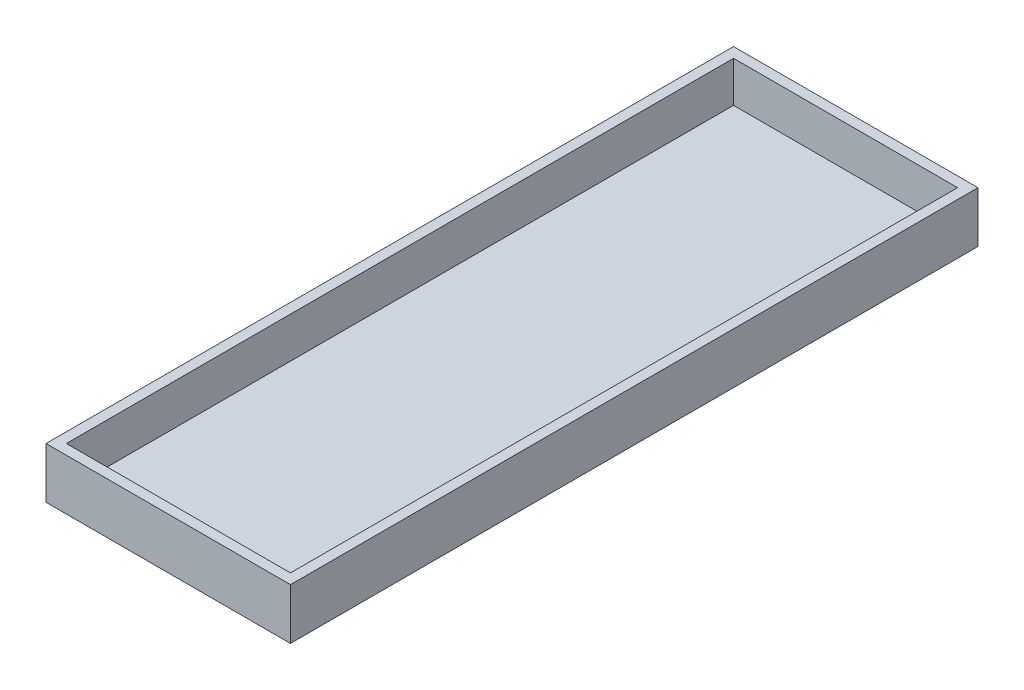
ISO-10303-21;
HEADER;
FILE_DESCRIPTION(('STEP AP214'),'2;1');
FILE_NAME('part.step','',(''),(''),'','','');
FILE_SCHEMA(('AUTOMOTIVE_DESIGN { 1 0 10303 214 1 1 1 1 }'));
ENDSEC;
DATA;
#1=APPLICATION_CONTEXT('core data for automotive mechanical design processes');
#2=APPLICATION_PROTOCOL_DEFINITION('international standard','automotive_design',2000,#1);
#3=PRODUCT_CONTEXT('',#1,'mechanical');
#4=PRODUCT('Part','Part','',(#3));
#5=PRODUCT_RELATED_PRODUCT_CATEGORY('part','',(#4));
#6=PRODUCT_DEFINITION_FORMATION('','',#4);
#7=PRODUCT_DEFINITION_CONTEXT('part definition',#1,'design');
#8=PRODUCT_DEFINITION('design','',#6,#7);
#9=PRODUCT_DEFINITION_SHAPE('','',#8);
#10=(LENGTH_UNIT() NAMED_UNIT(*) SI_UNIT(.MILLI.,.METRE.));
#11=(NAMED_UNIT(*) PLANE_ANGLE_UNIT() SI_UNIT($,.RADIAN.));
#12=(NAMED_UNIT(*) SI_UNIT($,.STERADIAN.) SOLID_ANGLE_UNIT());
#13=UNCERTAINTY_MEASURE_WITH_UNIT(LENGTH_MEASURE(1.E-05),#10,'distance_accuracy_value','');
#14=(GEOMETRIC_REPRESENTATION_CONTEXT(3) GLOBAL_UNCERTAINTY_ASSIGNED_CONTEXT((#13)) GLOBAL_UNIT_ASSIGNED_CONTEXT((#10,
#11,#12)) REPRESENTATION_CONTEXT('',''));
#15=CARTESIAN_POINT('',(0.,0.,0.));
#16=DIRECTION('',(0.,0.,1.));
#17=DIRECTION('',(1.,0.,0.));
#18=AXIS2_PLACEMENT_3D('',#15,#16,#17);
#19=CARTESIAN_POINT('',(0.,20.,-270.));
#20=DIRECTION('',(0.,1.,0.));
#21=DIRECTION('',(-1.,0.,0.));
#22=AXIS2_PLACEMENT_3D('',#19,#20,#21);
#23=PLANE('',#22);
#24=DIRECTION('',(-1.,0.,0.));
#25=VECTOR('',#24,1.);
#26=CARTESIAN_POINT('',(0.,20.,0.));
#27=LINE('',#26,#25);
#28=CARTESIAN_POINT('',(96.,20.,0.));
#29=VERTEX_POINT('',#28);
#30=CARTESIAN_POINT('',(0.,20.,0.));
#31=VERTEX_POINT('',#30);
#32=EDGE_CURVE('E150',#29,#31,#27,.T.);
#33=ORIENTED_EDGE('',*,*,#32,.F.);
#34=DIRECTION('',(0.,0.,1.));
#35=VECTOR('',#34,1.);
#36=CARTESIAN_POINT('',(96.,20.,-270.));
#37=LINE('',#36,#35);
#38=CARTESIAN_POINT('',(96.,20.,-270.));
#39=VERTEX_POINT('',#38);
#40=EDGE_CURVE('E42',#39,#29,#37,.T.);
#41=ORIENTED_EDGE('',*,*,#40,.F.);
#42=DIRECTION('',(-1.,0.,0.));
#43=VECTOR('',#42,1.);
#44=CARTESIAN_POINT('',(0.,20.,-270.));
#45=LINE('',#44,#43);
#46=CARTESIAN_POINT('',(0.,20.,-270.));
#47=VERTEX_POINT('',#46);
#48=EDGE_CURVE('E155',#39,#47,#45,.T.);
#49=ORIENTED_EDGE('',*,*,#48,.T.);
#50=DIRECTION('',(0.,0.,1.));
#51=VECTOR('',#50,1.);
#52=CARTESIAN_POINT('',(0.,20.,-270.));
#53=LINE('',#52,#51);
#54=EDGE_CURVE('E11',#47,#31,#53,.T.);
#55=ORIENTED_EDGE('',*,*,#54,.T.);
#56=EDGE_LOOP('',(#33,#41,#49,#55));
#57=FACE_BOUND('',#56,.T.);
#58=DIRECTION('',(0.,0.,1.));
#59=VECTOR('',#58,1.);
#60=CARTESIAN_POINT('',(92.,20.,-270.));
#61=LINE('',#60,#59);
#62=CARTESIAN_POINT('',(92.,20.,-266.));
#63=VERTEX_POINT('',#62);
#64=CARTESIAN_POINT('',(92.,20.,-4.));
#65=VERTEX_POINT('',#64);
#66=EDGE_CURVE('E138',#63,#65,#61,.T.);
#67=ORIENTED_EDGE('',*,*,#66,.T.);
#68=DIRECTION('',(-1.,0.,0.));
#69=VECTOR('',#68,1.);
#70=CARTESIAN_POINT('',(0.,20.,-4.));
#71=LINE('',#70,#69);
#72=CARTESIAN_POINT('',(4.,20.,-4.));
#73=VERTEX_POINT('',#72);
#74=EDGE_CURVE('E133',#65,#73,#71,.T.);
#75=ORIENTED_EDGE('',*,*,#74,.T.);
#76=DIRECTION('',(0.,0.,1.));
#77=VECTOR('',#76,1.);
#78=CARTESIAN_POINT('',(4.,20.,-270.));
#79=LINE('',#78,#77);
#80=CARTESIAN_POINT('',(4.,20.,-266.));
#81=VERTEX_POINT('',#80);
#82=EDGE_CURVE('E129',#81,#73,#79,.T.);
#83=ORIENTED_EDGE('',*,*,#82,.F.);
#84=DIRECTION('',(-1.,0.,0.));
#85=VECTOR('',#84,1.);
#86=CARTESIAN_POINT('',(0.,20.,-266.));
#87=LINE('',#86,#85);
#88=EDGE_CURVE('E50',#63,#81,#87,.T.);
#89=ORIENTED_EDGE('',*,*,#88,.F.);
#90=EDGE_LOOP('',(#67,#75,#83,#89));
#91=FACE_BOUND('',#90,.T.);
#92=ADVANCED_FACE('F33',(#57,#91),#23,.T.);
#93=CARTESIAN_POINT('',(0.,0.,-270.));
#94=DIRECTION('',(-1.,0.,0.));
#95=DIRECTION('',(0.,0.,1.));
#96=AXIS2_PLACEMENT_3D('',#93,#94,#95);
#97=PLANE('',#96);
#98=DIRECTION('',(0.,-1.,0.));
#99=VECTOR('',#98,1.);
#100=CARTESIAN_POINT('',(0.,0.,0.));
#101=LINE('',#100,#99);
#102=CARTESIAN_POINT('',(0.,0.,0.));
#103=VERTEX_POINT('',#102);
#104=EDGE_CURVE('E142',#31,#103,#101,.T.);
#105=ORIENTED_EDGE('',*,*,#104,.F.);
#106=ORIENTED_EDGE('',*,*,#54,.F.);
#107=DIRECTION('',(0.,-1.,0.));
#108=VECTOR('',#107,1.);
#109=CARTESIAN_POINT('',(0.,0.,-270.));
#110=LINE('',#109,#108);
#111=CARTESIAN_POINT('',(0.,0.,-270.));
#112=VERTEX_POINT('',#111);
#113=EDGE_CURVE('E147',#47,#112,#110,.T.);
#114=ORIENTED_EDGE('',*,*,#113,.T.);
#115=DIRECTION('',(0.,0.,1.));
#116=VECTOR('',#115,1.);
#117=CARTESIAN_POINT('',(0.,0.,-270.));
#118=LINE('',#117,#116);
#119=EDGE_CURVE('E37',#112,#103,#118,.T.);
#120=ORIENTED_EDGE('',*,*,#119,.T.);
#121=EDGE_LOOP('',(#105,#106,#114,#120));
#122=FACE_BOUND('',#121,.T.);
#123=ADVANCED_FACE('F35',(#122),#97,.T.);
#124=CARTESIAN_POINT('',(96.,0.,-270.));
#125=DIRECTION('',(1.,0.,0.));
#126=DIRECTION('',(0.,0.,-1.));
#127=AXIS2_PLACEMENT_3D('',#124,#125,#126);
#128=PLANE('',#127);
#129=DIRECTION('',(0.,1.,0.));
#130=VECTOR('',#129,1.);
#131=CARTESIAN_POINT('',(96.,0.,0.));
#132=LINE('',#131,#130);
#133=CARTESIAN_POINT('',(96.,0.,0.));
#134=VERTEX_POINT('',#133);
#135=EDGE_CURVE('E162',#134,#29,#132,.T.);
#136=ORIENTED_EDGE('',*,*,#135,.F.);
#137=DIRECTION('',(0.,0.,1.));
#138=VECTOR('',#137,1.);
#139=CARTESIAN_POINT('',(96.,0.,-270.));
#140=LINE('',#139,#138);
#141=CARTESIAN_POINT('',(96.,0.,-270.));
#142=VERTEX_POINT('',#141);
#143=EDGE_CURVE('E167',#142,#134,#140,.T.);
#144=ORIENTED_EDGE('',*,*,#143,.F.);
#145=DIRECTION('',(0.,1.,0.));
#146=VECTOR('',#145,1.);
#147=CARTESIAN_POINT('',(96.,0.,-270.));
#148=LINE('',#147,#146);
#149=EDGE_CURVE('E152',#142,#39,#148,.T.);
#150=ORIENTED_EDGE('',*,*,#149,.T.);
#151=ORIENTED_EDGE('',*,*,#40,.T.);
#152=EDGE_LOOP('',(#136,#144,#150,#151));
#153=FACE_BOUND('',#152,.T.);
#154=ADVANCED_FACE('F176',(#153),#128,.T.);
#155=CARTESIAN_POINT('',(0.,0.,-270.));
#156=DIRECTION('',(0.,-1.,0.));
#157=DIRECTION('',(0.,0.,-1.));
#158=AXIS2_PLACEMENT_3D('',#155,#156,#157);
#159=PLANE('',#158);
#160=DIRECTION('',(1.,0.,0.));
#161=VECTOR('',#160,1.);
#162=CARTESIAN_POINT('',(0.,0.,0.));
#163=LINE('',#162,#161);
#164=EDGE_CURVE('E159',#103,#134,#163,.T.);
#165=ORIENTED_EDGE('',*,*,#164,.F.);
#166=ORIENTED_EDGE('',*,*,#119,.F.);
#167=DIRECTION('',(1.,0.,0.));
#168=VECTOR('',#167,1.);
#169=CARTESIAN_POINT('',(0.,0.,-270.));
#170=LINE('',#169,#168);
#171=EDGE_CURVE('E149',#112,#142,#170,.T.);
#172=ORIENTED_EDGE('',*,*,#171,.T.);
#173=ORIENTED_EDGE('',*,*,#143,.T.);
#174=EDGE_LOOP('',(#165,#166,#172,#173));
#175=FACE_BOUND('',#174,.T.);
#176=ADVANCED_FACE('F169',(#175),#159,.T.);
#177=CARTESIAN_POINT('',(0.,0.,-270.));
#178=DIRECTION('',(0.,0.,-1.));
#179=DIRECTION('',(-1.,0.,0.));
#180=AXIS2_PLACEMENT_3D('',#177,#178,#179);
#181=PLANE('',#180);
#182=ORIENTED_EDGE('',*,*,#113,.F.);
#183=ORIENTED_EDGE('',*,*,#48,.F.);
#184=ORIENTED_EDGE('',*,*,#149,.F.);
#185=ORIENTED_EDGE('',*,*,#171,.F.);
#186=EDGE_LOOP('',(#182,#183,#184,#185));
#187=FACE_BOUND('',#186,.T.);
#188=ADVANCED_FACE('F178',(#187),#181,.T.);
#189=CARTESIAN_POINT('',(0.,0.,0.));
#190=DIRECTION('',(0.,0.,-1.));
#191=DIRECTION('',(-1.,0.,0.));
#192=AXIS2_PLACEMENT_3D('',#189,#190,#191);
#193=PLANE('',#192);
#194=ORIENTED_EDGE('',*,*,#104,.T.);
#195=ORIENTED_EDGE('',*,*,#164,.T.);
#196=ORIENTED_EDGE('',*,*,#135,.T.);
#197=ORIENTED_EDGE('',*,*,#32,.T.);
#198=EDGE_LOOP('',(#194,#195,#196,#197));
#199=FACE_BOUND('',#198,.T.);
#200=ADVANCED_FACE('F171',(#199),#193,.F.);
#201=CARTESIAN_POINT('',(4.,0.,-270.));
#202=DIRECTION('',(-1.,0.,0.));
#203=DIRECTION('',(0.,0.,1.));
#204=AXIS2_PLACEMENT_3D('',#201,#202,#203);
#205=PLANE('',#204);
#206=DIRECTION('',(0.,-1.,0.));
#207=VECTOR('',#206,1.);
#208=CARTESIAN_POINT('',(4.,0.,-4.));
#209=LINE('',#208,#207);
#210=CARTESIAN_POINT('',(4.,4.,-4.));
#211=VERTEX_POINT('',#210);
#212=EDGE_CURVE('E123',#73,#211,#209,.T.);
#213=ORIENTED_EDGE('',*,*,#212,.T.);
#214=DIRECTION('',(0.,0.,1.));
#215=VECTOR('',#214,1.);
#216=CARTESIAN_POINT('',(4.,4.,-270.));
#217=LINE('',#216,#215);
#218=CARTESIAN_POINT('',(4.,4.,-266.));
#219=VERTEX_POINT('',#218);
#220=EDGE_CURVE('E108',#219,#211,#217,.T.);
#221=ORIENTED_EDGE('',*,*,#220,.F.);
#222=DIRECTION('',(0.,-1.,0.));
#223=VECTOR('',#222,1.);
#224=CARTESIAN_POINT('',(4.,0.,-266.));
#225=LINE('',#224,#223);
#226=EDGE_CURVE('E132',#81,#219,#225,.T.);
#227=ORIENTED_EDGE('',*,*,#226,.F.);
#228=ORIENTED_EDGE('',*,*,#82,.T.);
#229=EDGE_LOOP('',(#213,#221,#227,#228));
#230=FACE_BOUND('',#229,.T.);
#231=ADVANCED_FACE('F127',(#230),#205,.F.);
#232=CARTESIAN_POINT('',(92.,0.,-270.));
#233=DIRECTION('',(1.,0.,0.));
#234=DIRECTION('',(0.,0.,-1.));
#235=AXIS2_PLACEMENT_3D('',#232,#233,#234);
#236=PLANE('',#235);
#237=DIRECTION('',(0.,1.,0.));
#238=VECTOR('',#237,1.);
#239=CARTESIAN_POINT('',(92.,0.,-4.));
#240=LINE('',#239,#238);
#241=CARTESIAN_POINT('',(92.,4.,-4.));
#242=VERTEX_POINT('',#241);
#243=EDGE_CURVE('E125',#242,#65,#240,.T.);
#244=ORIENTED_EDGE('',*,*,#243,.T.);
#245=ORIENTED_EDGE('',*,*,#66,.F.);
#246=DIRECTION('',(0.,1.,0.));
#247=VECTOR('',#246,1.);
#248=CARTESIAN_POINT('',(92.,0.,-266.));
#249=LINE('',#248,#247);
#250=CARTESIAN_POINT('',(92.,4.,-266.));
#251=VERTEX_POINT('',#250);
#252=EDGE_CURVE('E136',#251,#63,#249,.T.);
#253=ORIENTED_EDGE('',*,*,#252,.F.);
#254=DIRECTION('',(0.,0.,1.));
#255=VECTOR('',#254,1.);
#256=CARTESIAN_POINT('',(92.,4.,-270.));
#257=LINE('',#256,#255);
#258=EDGE_CURVE('E116',#251,#242,#257,.T.);
#259=ORIENTED_EDGE('',*,*,#258,.T.);
#260=EDGE_LOOP('',(#244,#245,#253,#259));
#261=FACE_BOUND('',#260,.T.);
#262=ADVANCED_FACE('F225',(#261),#236,.F.);
#263=CARTESIAN_POINT('',(0.,4.,-270.));
#264=DIRECTION('',(0.,-1.,0.));
#265=DIRECTION('',(0.,0.,-1.));
#266=AXIS2_PLACEMENT_3D('',#263,#264,#265);
#267=PLANE('',#266);
#268=DIRECTION('',(1.,0.,0.));
#269=VECTOR('',#268,1.);
#270=CARTESIAN_POINT('',(0.,4.,-4.));
#271=LINE('',#270,#269);
#272=EDGE_CURVE('E111',#211,#242,#271,.T.);
#273=ORIENTED_EDGE('',*,*,#272,.T.);
#274=ORIENTED_EDGE('',*,*,#258,.F.);
#275=DIRECTION('',(1.,0.,0.));
#276=VECTOR('',#275,1.);
#277=CARTESIAN_POINT('',(0.,4.,-266.));
#278=LINE('',#277,#276);
#279=EDGE_CURVE('E113',#219,#251,#278,.T.);
#280=ORIENTED_EDGE('',*,*,#279,.F.);
#281=ORIENTED_EDGE('',*,*,#220,.T.);
#282=EDGE_LOOP('',(#273,#274,#280,#281));
#283=FACE_BOUND('',#282,.T.);
#284=ADVANCED_FACE('F110',(#283),#267,.F.);
#285=CARTESIAN_POINT('',(0.,0.,-266.));
#286=DIRECTION('',(0.,0.,-1.));
#287=DIRECTION('',(-1.,0.,0.));
#288=AXIS2_PLACEMENT_3D('',#285,#286,#287);
#289=PLANE('',#288);
#290=ORIENTED_EDGE('',*,*,#226,.T.);
#291=ORIENTED_EDGE('',*,*,#279,.T.);
#292=ORIENTED_EDGE('',*,*,#252,.T.);
#293=ORIENTED_EDGE('',*,*,#88,.T.);
#294=EDGE_LOOP('',(#290,#291,#292,#293));
#295=FACE_BOUND('',#294,.T.);
#296=ADVANCED_FACE('F243',(#295),#289,.F.);
#297=CARTESIAN_POINT('',(0.,0.,-4.));
#298=DIRECTION('',(0.,0.,-1.));
#299=DIRECTION('',(-1.,0.,0.));
#300=AXIS2_PLACEMENT_3D('',#297,#298,#299);
#301=PLANE('',#300);
#302=ORIENTED_EDGE('',*,*,#212,.F.);
#303=ORIENTED_EDGE('',*,*,#74,.F.);
#304=ORIENTED_EDGE('',*,*,#243,.F.);
#305=ORIENTED_EDGE('',*,*,#272,.F.);
#306=EDGE_LOOP('',(#302,#303,#304,#305));
#307=FACE_BOUND('',#306,.T.);
#308=ADVANCED_FACE('F121',(#307),#301,.T.);
#309=CLOSED_SHELL('',(#92,#123,#154,#176,#188,#200,#231,#262,#284,#296,#308));
#310=MANIFOLD_SOLID_BREP('B2',#309);
#311=ADVANCED_BREP_SHAPE_REPRESENTATION('',(#18,#310),#14);
#312=SHAPE_DEFINITION_REPRESENTATION(#9,#311);
ENDSEC;
END-ISO-10303-21;
